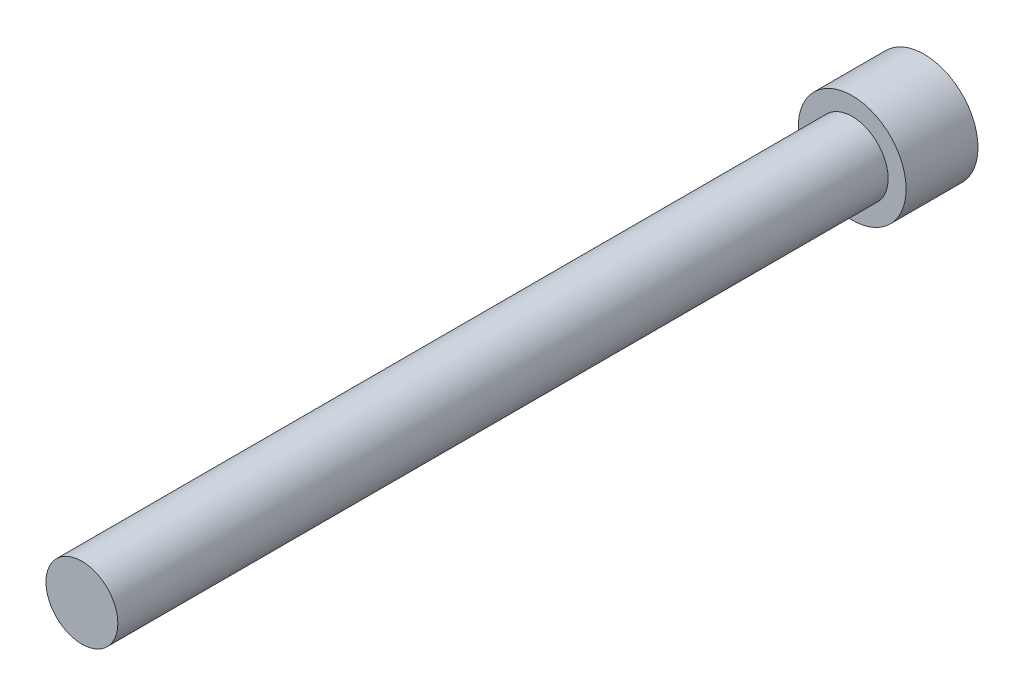
ISO-10303-21;
HEADER;
FILE_DESCRIPTION(('STEP AP214'),'2;1');
FILE_NAME('part.step','',(''),(''),'','','');
FILE_SCHEMA(('AUTOMOTIVE_DESIGN { 1 0 10303 214 1 1 1 1 }'));
ENDSEC;
DATA;
#1=APPLICATION_CONTEXT('core data for automotive mechanical design processes');
#2=APPLICATION_PROTOCOL_DEFINITION('international standard','automotive_design',2000,#1);
#3=PRODUCT_CONTEXT('',#1,'mechanical');
#4=PRODUCT('Part','Part','',(#3));
#5=PRODUCT_RELATED_PRODUCT_CATEGORY('part','',(#4));
#6=PRODUCT_DEFINITION_FORMATION('','',#4);
#7=PRODUCT_DEFINITION_CONTEXT('part definition',#1,'design');
#8=PRODUCT_DEFINITION('design','',#6,#7);
#9=PRODUCT_DEFINITION_SHAPE('','',#8);
#10=(LENGTH_UNIT() NAMED_UNIT(*) SI_UNIT(.MILLI.,.METRE.));
#11=(NAMED_UNIT(*) PLANE_ANGLE_UNIT() SI_UNIT($,.RADIAN.));
#12=(NAMED_UNIT(*) SI_UNIT($,.STERADIAN.) SOLID_ANGLE_UNIT());
#13=UNCERTAINTY_MEASURE_WITH_UNIT(LENGTH_MEASURE(1.E-05),#10,'distance_accuracy_value','');
#14=(GEOMETRIC_REPRESENTATION_CONTEXT(3) GLOBAL_UNCERTAINTY_ASSIGNED_CONTEXT((#13)) GLOBAL_UNIT_ASSIGNED_CONTEXT((#10,
#11,#12)) REPRESENTATION_CONTEXT('',''));
#15=CARTESIAN_POINT('',(0.,0.,0.));
#16=DIRECTION('',(0.,0.,1.));
#17=DIRECTION('',(1.,0.,0.));
#18=AXIS2_PLACEMENT_3D('',#15,#16,#17);
#19=CARTESIAN_POINT('',(-16.4104837985818,16.5449959608653,14.));
#20=DIRECTION('',(0.,0.,-1.));
#21=DIRECTION('',(-1.,0.,0.));
#22=AXIS2_PLACEMENT_3D('',#19,#20,#21);
#23=CYLINDRICAL_SURFACE('',#22,10.5);
#24=CARTESIAN_POINT('',(-16.4104837985818,16.5449959608653,14.));
#25=DIRECTION('',(0.,0.,1.));
#26=DIRECTION('',(1.,0.,0.));
#27=AXIS2_PLACEMENT_3D('',#24,#25,#26);
#28=CIRCLE('',#27,10.5);
#29=CARTESIAN_POINT('',(-5.91048379858179,16.5449959608653,14.));
#30=VERTEX_POINT('',#29);
#31=EDGE_CURVE('E45',#30,#30,#28,.T.);
#32=ORIENTED_EDGE('',*,*,#31,.F.);
#33=EDGE_LOOP('',(#32));
#34=FACE_BOUND('',#33,.T.);
#35=CARTESIAN_POINT('',(-16.4104837985818,16.5449959608653,0.));
#36=DIRECTION('',(0.,0.,1.));
#37=DIRECTION('',(1.,0.,0.));
#38=AXIS2_PLACEMENT_3D('',#35,#36,#37);
#39=CIRCLE('',#38,10.5);
#40=CARTESIAN_POINT('',(-5.91048379858179,16.5449959608653,0.));
#41=VERTEX_POINT('',#40);
#42=EDGE_CURVE('E40',#41,#41,#39,.T.);
#43=ORIENTED_EDGE('',*,*,#42,.T.);
#44=EDGE_LOOP('',(#43));
#45=FACE_BOUND('',#44,.T.);
#46=ADVANCED_FACE('F37',(#34,#45),#23,.T.);
#47=CARTESIAN_POINT('',(-16.4104837985818,16.5449959608653,14.));
#48=DIRECTION('',(0.,0.,1.));
#49=DIRECTION('',(1.,0.,0.));
#50=AXIS2_PLACEMENT_3D('',#47,#48,#49);
#51=PLANE('',#50);
#52=CARTESIAN_POINT('',(-16.4104837985818,16.5449959608653,14.));
#53=DIRECTION('',(0.,0.,1.));
#54=DIRECTION('',(1.,0.,0.));
#55=AXIS2_PLACEMENT_3D('',#52,#53,#54);
#56=CIRCLE('',#55,7.);
#57=CARTESIAN_POINT('',(-9.41048379858179,16.5449959608653,14.));
#58=VERTEX_POINT('',#57);
#59=EDGE_CURVE('E10',#58,#58,#56,.T.);
#60=ORIENTED_EDGE('',*,*,#59,.F.);
#61=EDGE_LOOP('',(#60));
#62=FACE_BOUND('',#61,.T.);
#63=ORIENTED_EDGE('',*,*,#31,.T.);
#64=EDGE_LOOP('',(#63));
#65=FACE_BOUND('',#64,.T.);
#66=ADVANCED_FACE('F65',(#62,#65),#51,.T.);
#67=CARTESIAN_POINT('',(-16.4104837985818,16.5449959608653,0.));
#68=DIRECTION('',(0.,0.,1.));
#69=DIRECTION('',(1.,0.,0.));
#70=AXIS2_PLACEMENT_3D('',#67,#68,#69);
#71=PLANE('',#70);
#72=ORIENTED_EDGE('',*,*,#42,.F.);
#73=EDGE_LOOP('',(#72));
#74=FACE_BOUND('',#73,.T.);
#75=ADVANCED_FACE('F62',(#74),#71,.F.);
#76=CARTESIAN_POINT('',(-16.4104837985818,16.5449959608653,164.));
#77=DIRECTION('',(0.,0.,-1.));
#78=DIRECTION('',(-1.,0.,0.));
#79=AXIS2_PLACEMENT_3D('',#76,#77,#78);
#80=CYLINDRICAL_SURFACE('',#79,7.);
#81=CARTESIAN_POINT('',(-16.4104837985818,16.5449959608653,164.));
#82=DIRECTION('',(0.,0.,1.));
#83=DIRECTION('',(1.,0.,0.));
#84=AXIS2_PLACEMENT_3D('',#81,#82,#83);
#85=CIRCLE('',#84,7.);
#86=CARTESIAN_POINT('',(-9.41048379858179,16.5449959608653,164.));
#87=VERTEX_POINT('',#86);
#88=EDGE_CURVE('E52',#87,#87,#85,.T.);
#89=ORIENTED_EDGE('',*,*,#88,.F.);
#90=EDGE_LOOP('',(#89));
#91=FACE_BOUND('',#90,.T.);
#92=ORIENTED_EDGE('',*,*,#59,.T.);
#93=EDGE_LOOP('',(#92));
#94=FACE_BOUND('',#93,.T.);
#95=ADVANCED_FACE('F64',(#91,#94),#80,.T.);
#96=CARTESIAN_POINT('',(-16.4104837985818,16.5449959608653,164.));
#97=DIRECTION('',(0.,0.,1.));
#98=DIRECTION('',(1.,0.,0.));
#99=AXIS2_PLACEMENT_3D('',#96,#97,#98);
#100=PLANE('',#99);
#101=ORIENTED_EDGE('',*,*,#88,.T.);
#102=EDGE_LOOP('',(#101));
#103=FACE_BOUND('',#102,.T.);
#104=ADVANCED_FACE('F70',(#103),#100,.T.);
#105=CLOSED_SHELL('',(#46,#66,#75,#95,#104));
#106=MANIFOLD_SOLID_BREP('B2',#105);
#107=ADVANCED_BREP_SHAPE_REPRESENTATION('',(#18,#106),#14);
#108=SHAPE_DEFINITION_REPRESENTATION(#9,#107);
ENDSEC;
END-ISO-10303-21;
